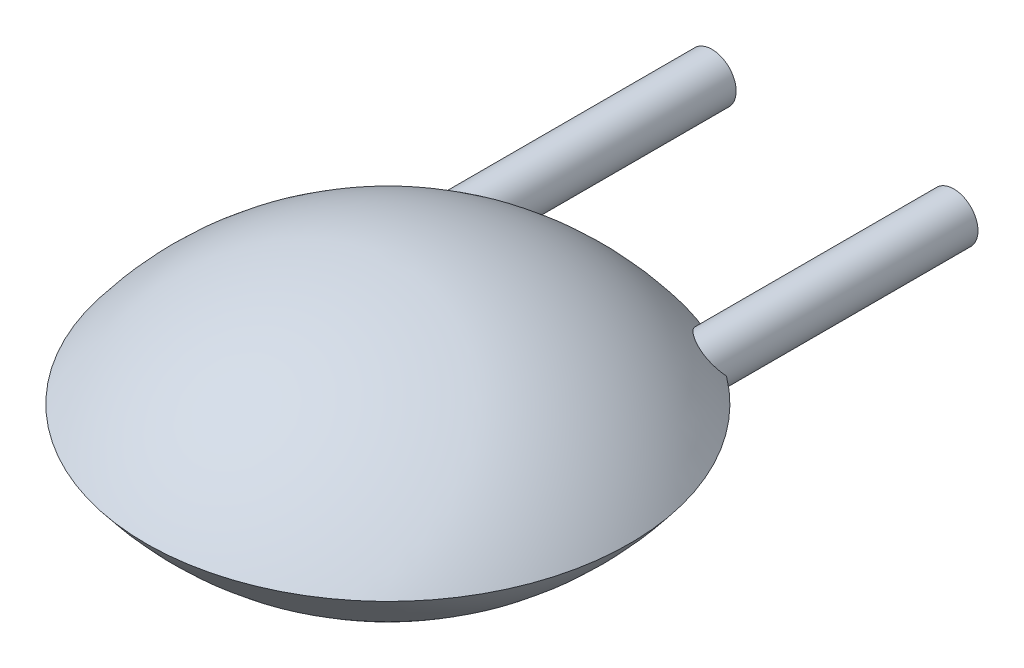
ISO-10303-21;
HEADER;
FILE_DESCRIPTION(('STEP AP214'),'2;1');
FILE_NAME('part.step','',(''),(''),'','','');
FILE_SCHEMA(('AUTOMOTIVE_DESIGN { 1 0 10303 214 1 1 1 1 }'));
ENDSEC;
DATA;
#1=APPLICATION_CONTEXT('core data for automotive mechanical design processes');
#2=APPLICATION_PROTOCOL_DEFINITION('international standard','automotive_design',2000,#1);
#3=PRODUCT_CONTEXT('',#1,'mechanical');
#4=PRODUCT('Part','Part','',(#3));
#5=PRODUCT_RELATED_PRODUCT_CATEGORY('part','',(#4));
#6=PRODUCT_DEFINITION_FORMATION('','',#4);
#7=PRODUCT_DEFINITION_CONTEXT('part definition',#1,'design');
#8=PRODUCT_DEFINITION('design','',#6,#7);
#9=PRODUCT_DEFINITION_SHAPE('','',#8);
#10=(LENGTH_UNIT() NAMED_UNIT(*) SI_UNIT(.MILLI.,.METRE.));
#11=(NAMED_UNIT(*) PLANE_ANGLE_UNIT() SI_UNIT($,.RADIAN.));
#12=(NAMED_UNIT(*) SI_UNIT($,.STERADIAN.) SOLID_ANGLE_UNIT());
#13=UNCERTAINTY_MEASURE_WITH_UNIT(LENGTH_MEASURE(1.E-05),#10,'distance_accuracy_value','');
#14=(GEOMETRIC_REPRESENTATION_CONTEXT(3) GLOBAL_UNCERTAINTY_ASSIGNED_CONTEXT((#13)) GLOBAL_UNIT_ASSIGNED_CONTEXT((#10,
#11,#12)) REPRESENTATION_CONTEXT('',''));
#15=CARTESIAN_POINT('',(0.,0.,0.));
#16=DIRECTION('',(0.,0.,1.));
#17=DIRECTION('',(1.,0.,0.));
#18=AXIS2_PLACEMENT_3D('',#15,#16,#17);
#19=CARTESIAN_POINT('',(2.5,0.25,-2.));
#20=DIRECTION('',(0.,0.,-1.));
#21=DIRECTION('',(0.,-1.,0.));
#22=AXIS2_PLACEMENT_3D('',#19,#20,#21);
#23=PLANE('',#22);
#24=CARTESIAN_POINT('',(2.5,0.,-2.));
#25=DIRECTION('',(0.,0.,1.));
#26=DIRECTION('',(0.,1.,0.));
#27=AXIS2_PLACEMENT_3D('',#24,#25,#26);
#28=CIRCLE('',#27,0.25);
#29=CARTESIAN_POINT('',(2.5,0.25,-2.));
#30=VERTEX_POINT('',#29);
#31=EDGE_CURVE('E11',#30,#30,#28,.T.);
#32=ORIENTED_EDGE('',*,*,#31,.F.);
#33=EDGE_LOOP('',(#32));
#34=FACE_BOUND('',#33,.T.);
#35=ADVANCED_FACE('F17',(#34),#23,.T.);
#36=CARTESIAN_POINT('',(2.5,0.,-2.));
#37=DIRECTION('',(0.,0.,-1.));
#38=DIRECTION('',(0.,1.,0.));
#39=AXIS2_PLACEMENT_3D('',#36,#37,#38);
#40=CYLINDRICAL_SURFACE('',#39,0.25);
#41=DIRECTION('',(0.,0.,1.));
#42=VECTOR('',#41,1.);
#43=CARTESIAN_POINT('',(2.5,0.25,-2.));
#44=LINE('',#43,#42);
#45=CARTESIAN_POINT('',(2.5,0.25,0.679713563033));
#46=VERTEX_POINT('',#45);
#47=EDGE_CURVE('E25',#30,#46,#44,.T.);
#48=ORIENTED_EDGE('',*,*,#47,.T.);
#49=CARTESIAN_POINT('',(2.75,0.,0.6));
#50=CARTESIAN_POINT('',(2.75,0.009684935722549,0.60907962724));
#51=CARTESIAN_POINT('',(2.749562312585,0.01958663774088,0.618137008421));
#52=CARTESIAN_POINT('',(2.748651405776,0.02972573255005,0.627168846355));
#53=CARTESIAN_POINT('',(2.74722132271,0.04012175883062,0.63616421868));
#54=CARTESIAN_POINT('',(2.745209073056,0.05079675639222,0.645103357495));
#55=CARTESIAN_POINT('',(2.742537061215,0.06177469968621,0.65395826804));
#56=CARTESIAN_POINT('',(2.736139904849,0.08269557316476,0.670078636965));
#57=CARTESIAN_POINT('',(2.732704674351,0.09232384083339,0.677213594006));
#58=CARTESIAN_POINT('',(2.728740570253,0.101972617478,0.684056031738));
#59=CARTESIAN_POINT('',(2.72421771453,0.111618402993,0.690558940343));
#60=CARTESIAN_POINT('',(2.71910612962,0.121228653412,0.696665536009));
#61=CARTESIAN_POINT('',(2.71337879605,0.130760638679,0.702310163106));
#62=CARTESIAN_POINT('',(2.703102719827,0.145938252692,0.710559708365));
#63=CARTESIAN_POINT('',(2.698861795951,0.15179743003,0.713569505904));
#64=CARTESIAN_POINT('',(2.694252637492,0.157741594389,0.716425500368));
#65=CARTESIAN_POINT('',(2.689235443481,0.163763565545,0.719093103762));
#66=CARTESIAN_POINT('',(2.683769912919,0.169845221109,0.721526228722));
#67=CARTESIAN_POINT('',(2.677815244776,0.175957496526,0.723667288523));
#68=CARTESIAN_POINT('',(2.661434654483,0.191372650099,0.728163120845));
#69=CARTESIAN_POINT('',(2.650771379058,0.200224266874,0.729910895033));
#70=CARTESIAN_POINT('',(2.639433383976,0.208451319354,0.730582732085));
#71=CARTESIAN_POINT('',(2.627539684801,0.215931925809,0.730132246231));
#72=CARTESIAN_POINT('',(2.615231033911,0.222580375228,0.728568826536));
#73=CARTESIAN_POINT('',(2.602669342049,0.22834679587,0.725956595391));
#74=CARTESIAN_POINT('',(2.574416671496,0.239254373799,0.718039961551));
#75=CARTESIAN_POINT('',(2.560129891044,0.243368610128,0.712649026434));
#76=CARTESIAN_POINT('',(2.54674363206,0.246305062973,0.706703296778));
#77=CARTESIAN_POINT('',(2.534183341358,0.248245212574,0.700340083924));
#78=CARTESIAN_POINT('',(2.522277426468,0.249444115193,0.693702912712));
#79=CARTESIAN_POINT('',(2.510927514729,0.249999998935,0.686826768264));
#80=CARTESIAN_POINT('',(2.5,0.25,0.679713563033));
#81=(BOUNDED_CURVE() B_SPLINE_CURVE(7,(#49,#50,#51,#52,#53,#54,#55,#56,#57,#58,#59,#60,#61,#62,
#63,#64,#65,#66,#67,#68,#69,#70,#71,#72,#73,#74,#75,#76,#77,#78,#79,#80),.UNSPECIFIED.,.F.,
.F.) B_SPLINE_CURVE_WITH_KNOTS((8,6,6,6,6,8),(0.,0.241317762403,0.44564446692,0.571243661275,
0.762892742603,1.),
.UNSPECIFIED.) CURVE() GEOMETRIC_REPRESENTATION_ITEM() RATIONAL_B_SPLINE_CURVE((1.,1.,1.,1.,1.,
1.,1.,1.,1.,1.,1.,1.,1.,1.,1.,1.,1.,1.,1.,1.,1.,1.,1.,1.,1.,1.,1.,1.,1.,1.,1.,1.)) REPRESENTATION_ITEM(''));
#82=CARTESIAN_POINT('',(2.75,0.,0.6));
#83=VERTEX_POINT('',#82);
#84=EDGE_CURVE('E130',#83,#46,#81,.T.);
#85=ORIENTED_EDGE('',*,*,#84,.F.);
#86=CARTESIAN_POINT('',(2.25,0.,0.308712152522));
#87=CARTESIAN_POINT('',(2.25,-0.01498658225447,0.320975928877));
#88=CARTESIAN_POINT('',(2.251026664409,-0.0297054748863,0.33365576418));
#89=CARTESIAN_POINT('',(2.253016149011,-0.0441520371316,0.346721914115));
#90=CARTESIAN_POINT('',(2.255926980942,-0.05831686688093,0.360152410532));
#91=CARTESIAN_POINT('',(2.25973256852,-0.07218729022304,0.373930341078));
#92=CARTESIAN_POINT('',(2.264417503979,-0.08574804864071,0.388042581312));
#93=CARTESIAN_POINT('',(2.269977659081,-0.09898118385844,0.402479979316));
#94=CARTESIAN_POINT('',(2.282545741639,-0.124100011711,0.431254501681));
#95=CARTESIAN_POINT('',(2.289463013308,-0.136012964562,0.445551929584));
#96=CARTESIAN_POINT('',(2.297185799383,-0.147589731702,0.460131967284));
#97=CARTESIAN_POINT('',(2.305733029147,-0.158806353915,0.474992312837));
#98=CARTESIAN_POINT('',(2.315134464997,-0.169628344586,0.490127953848));
#99=CARTESIAN_POINT('',(2.325429322822,-0.180011499427,0.505530700782));
#100=CARTESIAN_POINT('',(2.336672600964,-0.189899786788,0.521190841154));
#101=CARTESIAN_POINT('',(2.359499449155,-0.207206481998,0.550752974867));
#102=CARTESIAN_POINT('',(2.370771170976,-0.214748695336,0.564541460992));
#103=CARTESIAN_POINT('',(2.382858668306,-0.22182391066,0.578506701656));
#104=CARTESIAN_POINT('',(2.395850861729,-0.228367849352,0.592649461127));
#105=CARTESIAN_POINT('',(2.409826561431,-0.234285137732,0.606935464107));
#106=CARTESIAN_POINT('',(2.424885372869,-0.239426189605,0.621290562355));
#107=CARTESIAN_POINT('',(2.44110783289,-0.243619055254,0.635602327218));
#108=CARTESIAN_POINT('',(2.473532149108,-0.249048799008,0.661604294387));
#109=CARTESIAN_POINT('',(2.48946174847,-0.250669585469,0.673455104834));
#110=CARTESIAN_POINT('',(2.506495211862,-0.251196244911,0.685043508444));
#111=CARTESIAN_POINT('',(2.524527959388,-0.25035344694,0.696027839293));
#112=CARTESIAN_POINT('',(2.543343478254,-0.247854159514,0.705968391385));
#113=CARTESIAN_POINT('',(2.562611312742,-0.243478827201,0.71439698369));
#114=CARTESIAN_POINT('',(2.581859972017,-0.237084220733,0.720824079793));
#115=CARTESIAN_POINT('',(2.60910140322,-0.225137936334,0.72703893034));
#116=CARTESIAN_POINT('',(2.617738358649,-0.220900749239,0.728562265654));
#117=CARTESIAN_POINT('',(2.626259813584,-0.216244490771,0.729589797475));
#118=CARTESIAN_POINT('',(2.634614573331,-0.211181583927,0.730098382962));
#119=CARTESIAN_POINT('',(2.64275460938,-0.205733166384,0.730076494893));
#120=CARTESIAN_POINT('',(2.650635059402,-0.199929090505,0.729524221666));
#121=CARTESIAN_POINT('',(2.658214227257,-0.193807923338,0.728453267298));
#122=CARTESIAN_POINT('',(2.6791011494,-0.175368736441,0.723934147238));
#123=CARTESIAN_POINT('',(2.690480624416,-0.163302373898,0.71945490095));
#124=CARTESIAN_POINT('',(2.700238105406,-0.151299134573,0.713971427554));
#125=CARTESIAN_POINT('',(2.708612064754,-0.139401939545,0.707696815746));
#126=CARTESIAN_POINT('',(2.715848390387,-0.12763794673,0.700829677281));
#127=CARTESIAN_POINT('',(2.722086469132,-0.116002948178,0.693465245756));
#128=CARTESIAN_POINT('',(2.727458179432,-0.104476464661,0.685676374679));
#129=CARTESIAN_POINT('',(2.736866967883,-0.08100264916926,0.668900233661));
#130=CARTESIAN_POINT('',(2.740809574107,-0.0691100893002,0.659908845035));
#131=CARTESIAN_POINT('',(2.74397912937,-0.05732790968549,0.650573551891));
#132=CARTESIAN_POINT('',(2.746441454367,-0.04565321186873,0.640940284061));
#133=CARTESIAN_POINT('',(2.748243288901,-0.034084511786,0.631043013262));
#134=CARTESIAN_POINT('',(2.749420279743,-0.02262052324615,0.620908081359));
#135=CARTESIAN_POINT('',(2.75,-0.01125962337166,0.610555896911));
#136=CARTESIAN_POINT('',(2.75,0.,0.6));
#137=(BOUNDED_CURVE() B_SPLINE_CURVE(8,(#86,#87,#88,#89,#90,#91,#92,#93,#94,#95,#96,#97,#98,#99,
#100,#101,#102,#103,#104,#105,#106,#107,#108,#109,#110,#111,#112,#113,#114,#115,#116,#117,#118,
#119,#120,#121,#122,#123,#124,#125,#126,#127,#128,#129,#130,#131,#132,#133,#134,#135,#136),
.UNSPECIFIED.,.F.,.F.) B_SPLINE_CURVE_WITH_KNOTS((9,7,7,7,7,7,7,9),(0.,0.199458904289,
0.388869805961,0.551335379777,0.68813869263,0.75230881859,0.873281746118,1.),
.UNSPECIFIED.) CURVE() GEOMETRIC_REPRESENTATION_ITEM() RATIONAL_B_SPLINE_CURVE((1.,1.,1.,1.,1.,
1.,1.,1.,1.,1.,1.,1.,1.,1.,1.,1.,1.,1.,1.,1.,1.,1.,1.,1.,1.,1.,1.,1.,1.,1.,1.,1.,1.,1.,1.,1.,1.,
1.,1.,1.,1.,1.,1.,1.,1.,1.,1.,1.,1.,1.,1.)) REPRESENTATION_ITEM(''));
#138=CARTESIAN_POINT('',(2.25,0.,0.308712152522));
#139=VERTEX_POINT('',#138);
#140=EDGE_CURVE('E137',#139,#83,#137,.T.);
#141=ORIENTED_EDGE('',*,*,#140,.F.);
#142=CARTESIAN_POINT('',(2.5,0.25,0.679713563033));
#143=CARTESIAN_POINT('',(2.48331769468,0.249999998375,0.668854305725));
#144=CARTESIAN_POINT('',(2.467310645556,0.248701328528,0.657238205433));
#145=CARTESIAN_POINT('',(2.451964778403,0.246292795207,0.645058427306));
#146=CARTESIAN_POINT('',(2.437279649557,0.242904781034,0.632454202665));
#147=CARTESIAN_POINT('',(2.423245170708,0.238646669924,0.619533115346));
#148=CARTESIAN_POINT('',(2.4098439946,0.233600046124,0.606367996902));
#149=CARTESIAN_POINT('',(2.377490022523,0.218979596466,0.572558438836));
#150=CARTESIAN_POINT('',(2.359390171251,0.208441049644,0.551682950476));
#151=CARTESIAN_POINT('',(2.342683890601,0.196421562524,0.530553330357));
#152=CARTESIAN_POINT('',(2.327381770901,0.183060607605,0.509312840635));
#153=CARTESIAN_POINT('',(2.313503656583,0.168477015091,0.488081826717));
#154=CARTESIAN_POINT('',(2.301087743399,0.152757672751,0.466955654532));
#155=CARTESIAN_POINT('',(2.279433025968,0.119340154575,0.425299865378));
#156=CARTESIAN_POINT('',(2.270174862061,0.101690391405,0.404795744168));
#157=CARTESIAN_POINT('',(2.262480511199,0.08305904459994,0.384568703651));
#158=CARTESIAN_POINT('',(2.256453998714,0.0635032798938,0.364715891403));
#159=CARTESIAN_POINT('',(2.252237474048,0.04308939167547,0.345357068254));
#160=CARTESIAN_POINT('',(2.25,0.02189707437304,0.326630902667));
#161=CARTESIAN_POINT('',(2.25,0.,0.308712152522));
#162=(BOUNDED_CURVE() B_SPLINE_CURVE(7,(#142,#143,#144,#145,#146,#147,#148,#149,#150,#151,#152,
#153,#154,#155,#156,#157,#158,#159,#160,#161),.UNSPECIFIED.,.F.,
.F.) B_SPLINE_CURVE_WITH_KNOTS((8,6,6,8),(0.,0.247494418513,0.625913593946,1.),
.UNSPECIFIED.) CURVE() GEOMETRIC_REPRESENTATION_ITEM() RATIONAL_B_SPLINE_CURVE((1.,1.,1.,1.,1.,
1.,1.,1.,1.,1.,1.,1.,1.,1.,1.,1.,1.,1.,1.,1.)) REPRESENTATION_ITEM(''));
#163=EDGE_CURVE('E125',#46,#139,#162,.T.);
#164=ORIENTED_EDGE('',*,*,#163,.F.);
#165=ORIENTED_EDGE('',*,*,#47,.F.);
#166=ORIENTED_EDGE('',*,*,#31,.T.);
#167=EDGE_LOOP('',(#48,#85,#141,#164,#165,#166));
#168=FACE_BOUND('',#167,.T.);
#169=ADVANCED_FACE('F199',(#168),#40,.T.);
#170=CARTESIAN_POINT('',(1.25,-1.875,2.6));
#171=DIRECTION('',(0.,-1.,0.));
#172=DIRECTION('',(-1.,0.,0.));
#173=AXIS2_PLACEMENT_3D('',#170,#171,#172);
#174=SPHERICAL_SURFACE('',#173,3.125);
#175=CARTESIAN_POINT('',(1.25,-1.875,2.6));
#176=DIRECTION('',(0.,0.,1.));
#177=DIRECTION('',(0.,1.,0.));
#178=AXIS2_PLACEMENT_3D('',#175,#176,#177);
#179=CIRCLE('',#178,3.125);
#180=CARTESIAN_POINT('',(1.25,1.25,2.6));
#181=VERTEX_POINT('',#180);
#182=CARTESIAN_POINT('',(-1.25,0.,2.6));
#183=VERTEX_POINT('',#182);
#184=EDGE_CURVE('E143',#181,#183,#179,.T.);
#185=ORIENTED_EDGE('',*,*,#184,.F.);
#186=ORIENTED_EDGE('',*,*,#184,.T.);
#187=CARTESIAN_POINT('',(1.25,0.,2.6));
#188=DIRECTION('',(0.,-1.,0.));
#189=DIRECTION('',(-1.,0.,0.));
#190=AXIS2_PLACEMENT_3D('',#187,#188,#189);
#191=CIRCLE('',#190,2.5);
#192=EDGE_CURVE('E152',#83,#183,#191,.T.);
#193=ORIENTED_EDGE('',*,*,#192,.F.);
#194=ORIENTED_EDGE('',*,*,#84,.T.);
#195=ORIENTED_EDGE('',*,*,#163,.T.);
#196=CARTESIAN_POINT('',(1.25,0.,2.6));
#197=DIRECTION('',(0.,-1.,0.));
#198=DIRECTION('',(-1.,0.,0.));
#199=AXIS2_PLACEMENT_3D('',#196,#197,#198);
#200=CIRCLE('',#199,2.5);
#201=CARTESIAN_POINT('',(0.25,0.,0.308712152522));
#202=VERTEX_POINT('',#201);
#203=EDGE_CURVE('E124',#202,#139,#200,.T.);
#204=ORIENTED_EDGE('',*,*,#203,.F.);
#205=CARTESIAN_POINT('',(0.25,0.,0.308712152522));
#206=CARTESIAN_POINT('',(0.25,0.01498658225286,0.320975928876));
#207=CARTESIAN_POINT('',(0.248973335591,0.02970547488316,0.333655764178));
#208=CARTESIAN_POINT('',(0.24698385099,0.04415203712698,0.346721914111));
#209=CARTESIAN_POINT('',(0.24407301906,0.05831686687487,0.360152410527));
#210=CARTESIAN_POINT('',(0.240267431482,0.07218729021563,0.37393034107));
#211=CARTESIAN_POINT('',(0.235582496024,0.08574804863202,0.388042581303));
#212=CARTESIAN_POINT('',(0.230022340923,0.09898118384854,0.402479979305));
#213=CARTESIAN_POINT('',(0.217454258367,0.124100011701,0.43125450167));
#214=CARTESIAN_POINT('',(0.210536986697,0.136012964554,0.445551929575));
#215=CARTESIAN_POINT('',(0.202814200622,0.147589731695,0.460131967275));
#216=CARTESIAN_POINT('',(0.194266970857,0.15880635391,0.47499231283));
#217=CARTESIAN_POINT('',(0.184865535006,0.169628344583,0.490127953843));
#218=CARTESIAN_POINT('',(0.17457067718,0.180011499425,0.505530700778));
#219=CARTESIAN_POINT('',(0.163327399037,0.189899786787,0.521190841153));
#220=CARTESIAN_POINT('',(0.140500550844,0.207206481998,0.550752974867));
#221=CARTESIAN_POINT('',(0.129228829023,0.214748695337,0.564541460993));
#222=CARTESIAN_POINT('',(0.117141331693,0.22182391066,0.578506701658));
#223=CARTESIAN_POINT('',(0.104149138269,0.228367849353,0.592649461129));
#224=CARTESIAN_POINT('',(0.09017343856703,0.234285137733,0.606935464109));
#225=CARTESIAN_POINT('',(0.07511462712787,0.239426189606,0.621290562358));
#226=CARTESIAN_POINT('',(0.05889216710565,0.243619055255,0.635602327222));
#227=CARTESIAN_POINT('',(0.02646785088722,0.249048799009,0.66160429439));
#228=CARTESIAN_POINT('',(0.01053825152492,0.250669585469,0.673455104837));
#229=CARTESIAN_POINT('',(-0.006495211866636,0.251196244911,0.685043508447));
#230=CARTESIAN_POINT('',(-0.02452795939285,0.25035344694,0.696027839295));
#231=CARTESIAN_POINT('',(-0.04334347825754,0.247854159514,0.705968391387));
#232=CARTESIAN_POINT('',(-0.06261131274603,0.2434788272,0.714396983691));
#233=CARTESIAN_POINT('',(-0.08185997201987,0.237084220732,0.720824079794));
#234=CARTESIAN_POINT('',(-0.10910140322,0.225137936334,0.727038930339));
#235=CARTESIAN_POINT('',(-0.117738358649,0.220900749238,0.728562265654));
#236=CARTESIAN_POINT('',(-0.126259813586,0.21624449077,0.729589797475));
#237=CARTESIAN_POINT('',(-0.134614573334,0.211181583925,0.730098382962));
#238=CARTESIAN_POINT('',(-0.142754609382,0.205733166382,0.730076494893));
#239=CARTESIAN_POINT('',(-0.150635059404,0.199929090504,0.729524221666));
#240=CARTESIAN_POINT('',(-0.158214227257,0.193807923337,0.728453267298));
#241=CARTESIAN_POINT('',(-0.1791011494,0.175368736441,0.723934147238));
#242=CARTESIAN_POINT('',(-0.190480624416,0.163302373898,0.71945490095));
#243=CARTESIAN_POINT('',(-0.200238105405,0.151299134574,0.713971427554));
#244=CARTESIAN_POINT('',(-0.208612064754,0.139401939546,0.707696815747));
#245=CARTESIAN_POINT('',(-0.215848390386,0.127637946731,0.700829677282));
#246=CARTESIAN_POINT('',(-0.222086469131,0.116002948179,0.693465245757));
#247=CARTESIAN_POINT('',(-0.227458179431,0.104476464663,0.68567637468));
#248=CARTESIAN_POINT('',(-0.236866967882,0.08100264917104,0.668900233663));
#249=CARTESIAN_POINT('',(-0.240809574106,0.0691100893017,0.659908845036));
#250=CARTESIAN_POINT('',(-0.24397912937,0.05732790968674,0.650573551892));
#251=CARTESIAN_POINT('',(-0.246441454366,0.04565321186972,0.640940284062));
#252=CARTESIAN_POINT('',(-0.248243288901,0.03408451178674,0.631043013263));
#253=CARTESIAN_POINT('',(-0.249420279743,0.02262052324664,0.620908081359));
#254=CARTESIAN_POINT('',(-0.25,0.0112596233719,0.610555896911));
#255=CARTESIAN_POINT('',(-0.25,0.,0.6));
#256=(BOUNDED_CURVE() B_SPLINE_CURVE(8,(#205,#206,#207,#208,#209,#210,#211,#212,#213,#214,#215,
#216,#217,#218,#219,#220,#221,#222,#223,#224,#225,#226,#227,#228,#229,#230,#231,#232,#233,#234,
#235,#236,#237,#238,#239,#240,#241,#242,#243,#244,#245,#246,#247,#248,#249,#250,#251,#252,#253,
#254,#255),.UNSPECIFIED.,.F.,.F.) B_SPLINE_CURVE_WITH_KNOTS((9,7,7,7,7,7,7,9),(0.,
0.199458904293,0.388869806011,0.551335379852,0.68813869272,0.752308818663,0.873281746153,1.),
.UNSPECIFIED.) CURVE() GEOMETRIC_REPRESENTATION_ITEM() RATIONAL_B_SPLINE_CURVE((1.,1.,1.,1.,1.,
1.,1.,1.,1.,1.,1.,1.,1.,1.,1.,1.,1.,1.,1.,1.,1.,1.,1.,1.,1.,1.,1.,1.,1.,1.,1.,1.,1.,1.,1.,1.,1.,
1.,1.,1.,1.,1.,1.,1.,1.,1.,1.,1.,1.,1.,1.)) REPRESENTATION_ITEM(''));
#257=CARTESIAN_POINT('',(-0.25,0.,0.6));
#258=VERTEX_POINT('',#257);
#259=EDGE_CURVE('E94',#202,#258,#256,.T.);
#260=ORIENTED_EDGE('',*,*,#259,.T.);
#261=CARTESIAN_POINT('',(1.25,0.,2.6));
#262=DIRECTION('',(0.,-1.,0.));
#263=DIRECTION('',(-1.,0.,0.));
#264=AXIS2_PLACEMENT_3D('',#261,#262,#263);
#265=CIRCLE('',#264,2.5);
#266=EDGE_CURVE('E121',#183,#258,#265,.T.);
#267=ORIENTED_EDGE('',*,*,#266,.F.);
#268=EDGE_LOOP('',(#185,#186,#193,#194,#195,#204,#260,#267));
#269=FACE_BOUND('',#268,.T.);
#270=ADVANCED_FACE('F189',(#269),#174,.T.);
#271=CARTESIAN_POINT('',(1.25,1.875,2.6));
#272=DIRECTION('',(0.,-1.,0.));
#273=DIRECTION('',(-1.,0.,0.));
#274=AXIS2_PLACEMENT_3D('',#271,#272,#273);
#275=SPHERICAL_SURFACE('',#274,3.125);
#276=CARTESIAN_POINT('',(1.25,1.875,2.6));
#277=DIRECTION('',(0.,0.,1.));
#278=DIRECTION('',(-0.8,-0.6,0.));
#279=AXIS2_PLACEMENT_3D('',#276,#277,#278);
#280=CIRCLE('',#279,3.125);
#281=CARTESIAN_POINT('',(1.25,-1.25,2.6));
#282=VERTEX_POINT('',#281);
#283=EDGE_CURVE('E115',#183,#282,#280,.T.);
#284=ORIENTED_EDGE('',*,*,#283,.F.);
#285=ORIENTED_EDGE('',*,*,#266,.T.);
#286=CARTESIAN_POINT('',(-0.25,0.,0.6));
#287=CARTESIAN_POINT('',(-0.25,-0.009684935723134,0.60907962724));
#288=CARTESIAN_POINT('',(-0.249562312585,-0.01958663774209,0.618137008422));
#289=CARTESIAN_POINT('',(-0.248651405776,-0.02972573255191,0.627168846356));
#290=CARTESIAN_POINT('',(-0.247221322709,-0.04012175883314,0.636164218682));
#291=CARTESIAN_POINT('',(-0.245209073056,-0.05079675639546,0.645103357498));
#292=CARTESIAN_POINT('',(-0.242537061214,-0.06177469969022,0.653958268044));
#293=CARTESIAN_POINT('',(-0.236139904846,-0.0826955731734,0.670078636971));
#294=CARTESIAN_POINT('',(-0.232704674347,-0.09232384084319,0.677213594013));
#295=CARTESIAN_POINT('',(-0.228740570249,-0.101972617487,0.684056031744));
#296=CARTESIAN_POINT('',(-0.224217714526,-0.111618403002,0.690558940349));
#297=CARTESIAN_POINT('',(-0.219106129615,-0.12122865342,0.696665536014));
#298=CARTESIAN_POINT('',(-0.213378796045,-0.130760638688,0.702310163112));
#299=CARTESIAN_POINT('',(-0.203102719819,-0.145938252703,0.710559708371));
#300=CARTESIAN_POINT('',(-0.198861795942,-0.151797430041,0.71356950591));
#301=CARTESIAN_POINT('',(-0.194252637482,-0.157741594401,0.716425500374));
#302=CARTESIAN_POINT('',(-0.189235443471,-0.163763565557,0.719093103767));
#303=CARTESIAN_POINT('',(-0.183769912908,-0.169845221121,0.721526228727));
#304=CARTESIAN_POINT('',(-0.177815244764,-0.175957496539,0.723667288527));
#305=CARTESIAN_POINT('',(-0.161434654467,-0.191372650112,0.728163120848));
#306=CARTESIAN_POINT('',(-0.150771379041,-0.200224266886,0.729910895034));
#307=CARTESIAN_POINT('',(-0.13943338396,-0.208451319365,0.730582732085));
#308=CARTESIAN_POINT('',(-0.127539684786,-0.215931925818,0.730132246229));
#309=CARTESIAN_POINT('',(-0.115231033896,-0.222580375236,0.728568826534));
#310=CARTESIAN_POINT('',(-0.102669342034,-0.228346795877,0.725956595388));
#311=CARTESIAN_POINT('',(-0.07441667148544,-0.239254373802,0.718039961547));
#312=CARTESIAN_POINT('',(-0.06012989103581,-0.243368610129,0.71264902643));
#313=CARTESIAN_POINT('',(-0.04674363205343,-0.246305062974,0.706703296775));
#314=CARTESIAN_POINT('',(-0.03418334135388,-0.248245212574,0.700340083922));
#315=CARTESIAN_POINT('',(-0.02227742646536,-0.249444115193,0.69370291271));
#316=CARTESIAN_POINT('',(-0.01092751472784,-0.249999998935,0.686826768263));
#317=CARTESIAN_POINT('',(0.,-0.25,0.679713563033));
#318=(BOUNDED_CURVE() B_SPLINE_CURVE(7,(#286,#287,#288,#289,#290,#291,#292,#293,#294,#295,#296,
#297,#298,#299,#300,#301,#302,#303,#304,#305,#306,#307,#308,#309,#310,#311,#312,#313,#314,#315,
#316,#317),.UNSPECIFIED.,.F.,.F.) B_SPLINE_CURVE_WITH_KNOTS((8,6,6,6,6,8),(0.,0.241317762374,
0.445644466933,0.571243661289,0.762892742629,1.),
.UNSPECIFIED.) CURVE() GEOMETRIC_REPRESENTATION_ITEM() RATIONAL_B_SPLINE_CURVE((1.,1.,1.,1.,1.,
1.,1.,1.,1.,1.,1.,1.,1.,1.,1.,1.,1.,1.,1.,1.,1.,1.,1.,1.,1.,1.,1.,1.,1.,1.,1.,1.)) REPRESENTATION_ITEM(''));
#319=CARTESIAN_POINT('',(0.,-0.25,0.679713563033));
#320=VERTEX_POINT('',#319);
#321=EDGE_CURVE('E89',#258,#320,#318,.T.);
#322=ORIENTED_EDGE('',*,*,#321,.T.);
#323=CARTESIAN_POINT('',(0.,-0.25,0.679713563033));
#324=CARTESIAN_POINT('',(0.01668230531916,-0.249999998375,0.668854305725));
#325=CARTESIAN_POINT('',(0.03268935444351,-0.248701328528,0.657238205434));
#326=CARTESIAN_POINT('',(0.04803522159591,-0.246292795207,0.645058427307));
#327=CARTESIAN_POINT('',(0.06272035044142,-0.242904781035,0.632454202666));
#328=CARTESIAN_POINT('',(0.07675482928969,-0.238646669925,0.619533115348));
#329=CARTESIAN_POINT('',(0.09015600539763,-0.233600046125,0.606367996904));
#330=CARTESIAN_POINT('',(0.122509977475,-0.218979596467,0.572558438838));
#331=CARTESIAN_POINT('',(0.140609828749,-0.208441049645,0.551682950477));
#332=CARTESIAN_POINT('',(0.157316109399,-0.196421562524,0.530553330357));
#333=CARTESIAN_POINT('',(0.1726182291,-0.183060607604,0.509312840633));
#334=CARTESIAN_POINT('',(0.186496343419,-0.16847701509,0.488081826714));
#335=CARTESIAN_POINT('',(0.198912256603,-0.152757672748,0.466955654528));
#336=CARTESIAN_POINT('',(0.220566974034,-0.119340154572,0.425299865374));
#337=CARTESIAN_POINT('',(0.22982513794,-0.101690391402,0.404795744165));
#338=CARTESIAN_POINT('',(0.237519488802,-0.08305904459744,0.384568703648));
#339=CARTESIAN_POINT('',(0.243546001286,-0.0635032798917,0.364715891401));
#340=CARTESIAN_POINT('',(0.247762525952,-0.04308939167411,0.345357068252));
#341=CARTESIAN_POINT('',(0.25,-0.02189707437231,0.326630902667));
#342=CARTESIAN_POINT('',(0.25,0.,0.308712152522));
#343=(BOUNDED_CURVE() B_SPLINE_CURVE(7,(#323,#324,#325,#326,#327,#328,#329,#330,#331,#332,#333,
#334,#335,#336,#337,#338,#339,#340,#341,#342),.UNSPECIFIED.,.F.,
.F.) B_SPLINE_CURVE_WITH_KNOTS((8,6,6,8),(0.,0.247494418505,0.625913593958,1.),
.UNSPECIFIED.) CURVE() GEOMETRIC_REPRESENTATION_ITEM() RATIONAL_B_SPLINE_CURVE((1.,1.,1.,1.,1.,
1.,1.,1.,1.,1.,1.,1.,1.,1.,1.,1.,1.,1.,1.,1.)) REPRESENTATION_ITEM(''));
#344=EDGE_CURVE('E85',#320,#202,#343,.T.);
#345=ORIENTED_EDGE('',*,*,#344,.T.);
#346=ORIENTED_EDGE('',*,*,#203,.T.);
#347=ORIENTED_EDGE('',*,*,#140,.T.);
#348=ORIENTED_EDGE('',*,*,#192,.T.);
#349=ORIENTED_EDGE('',*,*,#283,.T.);
#350=EDGE_LOOP('',(#284,#285,#322,#345,#346,#347,#348,#349));
#351=FACE_BOUND('',#350,.T.);
#352=ADVANCED_FACE('F181',(#351),#275,.T.);
#353=CARTESIAN_POINT('',(0.,0.,-2.));
#354=DIRECTION('',(0.,0.,-1.));
#355=DIRECTION('',(0.,-1.,0.));
#356=AXIS2_PLACEMENT_3D('',#353,#354,#355);
#357=CYLINDRICAL_SURFACE('',#356,0.25);
#358=DIRECTION('',(0.,0.,1.));
#359=VECTOR('',#358,1.);
#360=CARTESIAN_POINT('',(0.,-0.25,-2.));
#361=LINE('',#360,#359);
#362=CARTESIAN_POINT('',(0.,-0.25,-2.));
#363=VERTEX_POINT('',#362);
#364=EDGE_CURVE('E79',#363,#320,#361,.T.);
#365=ORIENTED_EDGE('',*,*,#364,.T.);
#366=ORIENTED_EDGE('',*,*,#321,.F.);
#367=ORIENTED_EDGE('',*,*,#259,.F.);
#368=ORIENTED_EDGE('',*,*,#344,.F.);
#369=ORIENTED_EDGE('',*,*,#364,.F.);
#370=CARTESIAN_POINT('',(0.,0.,-2.));
#371=DIRECTION('',(0.,0.,1.));
#372=DIRECTION('',(0.,-1.,0.));
#373=AXIS2_PLACEMENT_3D('',#370,#371,#372);
#374=CIRCLE('',#373,0.25);
#375=EDGE_CURVE('E82',#363,#363,#374,.T.);
#376=ORIENTED_EDGE('',*,*,#375,.T.);
#377=EDGE_LOOP('',(#365,#366,#367,#368,#369,#376));
#378=FACE_BOUND('',#377,.T.);
#379=ADVANCED_FACE('F80',(#378),#357,.T.);
#380=CARTESIAN_POINT('',(0.,-0.25,-2.));
#381=DIRECTION('',(0.,0.,-1.));
#382=DIRECTION('',(0.,-1.,0.));
#383=AXIS2_PLACEMENT_3D('',#380,#381,#382);
#384=PLANE('',#383);
#385=ORIENTED_EDGE('',*,*,#375,.F.);
#386=EDGE_LOOP('',(#385));
#387=FACE_BOUND('',#386,.T.);
#388=ADVANCED_FACE('F167',(#387),#384,.T.);
#389=CLOSED_SHELL('',(#35,#169,#270,#352,#379,#388));
#390=MANIFOLD_SOLID_BREP('B1',#389);
#391=ADVANCED_BREP_SHAPE_REPRESENTATION('',(#18,#390),#14);
#392=SHAPE_DEFINITION_REPRESENTATION(#9,#391);
ENDSEC;
END-ISO-10303-21;
